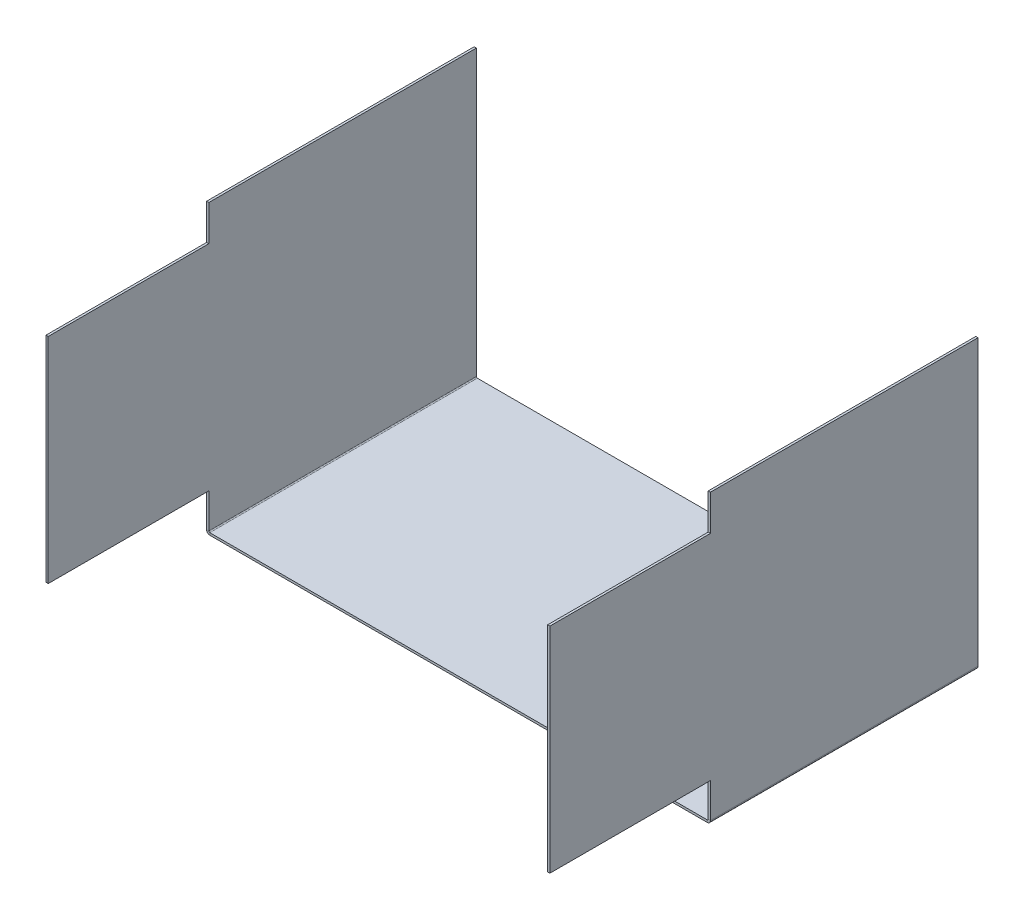
ISO-10303-21;
HEADER;
FILE_DESCRIPTION(('STEP AP214'),'2;1');
FILE_NAME('part.step','',(''),(''),'','','');
FILE_SCHEMA(('AUTOMOTIVE_DESIGN { 1 0 10303 214 1 1 1 1 }'));
ENDSEC;
DATA;
#1=APPLICATION_CONTEXT('core data for automotive mechanical design processes');
#2=APPLICATION_PROTOCOL_DEFINITION('international standard','automotive_design',2000,#1);
#3=PRODUCT_CONTEXT('',#1,'mechanical');
#4=PRODUCT('Part','Part','',(#3));
#5=PRODUCT_RELATED_PRODUCT_CATEGORY('part','',(#4));
#6=PRODUCT_DEFINITION_FORMATION('','',#4);
#7=PRODUCT_DEFINITION_CONTEXT('part definition',#1,'design');
#8=PRODUCT_DEFINITION('design','',#6,#7);
#9=PRODUCT_DEFINITION_SHAPE('','',#8);
#10=(LENGTH_UNIT() NAMED_UNIT(*) SI_UNIT(.MILLI.,.METRE.));
#11=(NAMED_UNIT(*) PLANE_ANGLE_UNIT() SI_UNIT($,.RADIAN.));
#12=(NAMED_UNIT(*) SI_UNIT($,.STERADIAN.) SOLID_ANGLE_UNIT());
#13=UNCERTAINTY_MEASURE_WITH_UNIT(LENGTH_MEASURE(1.E-05),#10,'distance_accuracy_value','');
#14=(GEOMETRIC_REPRESENTATION_CONTEXT(3) GLOBAL_UNCERTAINTY_ASSIGNED_CONTEXT((#13)) GLOBAL_UNIT_ASSIGNED_CONTEXT((#10,
#11,#12)) REPRESENTATION_CONTEXT('',''));
#15=CARTESIAN_POINT('',(0.,0.,0.));
#16=DIRECTION('',(0.,0.,1.));
#17=DIRECTION('',(1.,0.,0.));
#18=AXIS2_PLACEMENT_3D('',#15,#16,#17);
#19=CARTESIAN_POINT('',(-1.58750000000069,204.787500000001,127.));
#20=DIRECTION('',(0.,0.,1.));
#21=DIRECTION('',(0.,-1.,0.));
#22=AXIS2_PLACEMENT_3D('',#19,#20,#21);
#23=PLANE('',#22);
#24=DIRECTION('',(0.,-1.,0.));
#25=VECTOR('',#24,1.);
#26=CARTESIAN_POINT('',(0.,0.,127.));
#27=LINE('',#26,#25);
#28=CARTESIAN_POINT('',(-7.09285061240017E-13,204.787500000001,127.));
#29=VERTEX_POINT('',#28);
#30=CARTESIAN_POINT('',(0.,2.32409999999998,127.));
#31=VERTEX_POINT('',#30);
#32=EDGE_CURVE('E288',#29,#31,#27,.T.);
#33=ORIENTED_EDGE('',*,*,#32,.T.);
#34=DIRECTION('',(-1.,0.,0.));
#35=VECTOR('',#34,1.);
#36=CARTESIAN_POINT('',(0.,2.32409999999998,127.));
#37=LINE('',#36,#35);
#38=CARTESIAN_POINT('',(-1.58750000000135,2.32409999999994,127.));
#39=VERTEX_POINT('',#38);
#40=EDGE_CURVE('E11',#31,#39,#37,.T.);
#41=ORIENTED_EDGE('',*,*,#40,.T.);
#42=DIRECTION('',(0.,-1.,0.));
#43=VECTOR('',#42,1.);
#44=CARTESIAN_POINT('',(-1.58750000000069,204.787500000001,127.));
#45=LINE('',#44,#43);
#46=CARTESIAN_POINT('',(-1.58750000000071,204.7875,127.));
#47=VERTEX_POINT('',#46);
#48=EDGE_CURVE('E55',#47,#39,#45,.T.);
#49=ORIENTED_EDGE('',*,*,#48,.F.);
#50=DIRECTION('',(1.,0.,0.));
#51=VECTOR('',#50,1.);
#52=CARTESIAN_POINT('',(-1.58750000000069,204.787500000001,127.));
#53=LINE('',#52,#51);
#54=EDGE_CURVE('E198',#47,#29,#53,.T.);
#55=ORIENTED_EDGE('',*,*,#54,.T.);
#56=EDGE_LOOP('',(#33,#41,#49,#55));
#57=FACE_BOUND('',#56,.T.);
#58=ADVANCED_FACE('F41',(#57),#23,.F.);
#59=DIRECTION('',(-1.,0.,0.));
#60=VECTOR('',#59,1.);
#61=CARTESIAN_POINT('',(355.6,0.,127.));
#62=LINE('',#61,#60);
#63=CARTESIAN_POINT('',(354.8634,0.,127.));
#64=VERTEX_POINT('',#63);
#65=CARTESIAN_POINT('',(0.736599999999995,0.,127.));
#66=VERTEX_POINT('',#65);
#67=EDGE_CURVE('E277',#64,#66,#62,.T.);
#68=ORIENTED_EDGE('',*,*,#67,.T.);
#69=DIRECTION('',(0.,1.,0.));
#70=VECTOR('',#69,1.);
#71=CARTESIAN_POINT('',(0.736599999999995,0.,127.));
#72=LINE('',#71,#70);
#73=CARTESIAN_POINT('',(0.736599999999995,1.58749999999999,127.));
#74=VERTEX_POINT('',#73);
#75=EDGE_CURVE('E49',#66,#74,#72,.T.);
#76=ORIENTED_EDGE('',*,*,#75,.T.);
#77=DIRECTION('',(-1.,0.,0.));
#78=VECTOR('',#77,1.);
#79=CARTESIAN_POINT('',(355.6,1.58749999999998,127.));
#80=LINE('',#79,#78);
#81=CARTESIAN_POINT('',(354.8634,1.58749999999998,127.));
#82=VERTEX_POINT('',#81);
#83=EDGE_CURVE('E274',#82,#74,#80,.T.);
#84=ORIENTED_EDGE('',*,*,#83,.F.);
#85=DIRECTION('',(0.,-1.,0.));
#86=VECTOR('',#85,1.);
#87=CARTESIAN_POINT('',(354.8634,1.58749999999998,127.));
#88=LINE('',#87,#86);
#89=EDGE_CURVE('E267',#82,#64,#88,.T.);
#90=ORIENTED_EDGE('',*,*,#89,.T.);
#91=EDGE_LOOP('',(#68,#76,#84,#90));
#92=FACE_BOUND('',#91,.T.);
#93=ADVANCED_FACE('F272',(#92),#23,.F.);
#94=ORIENTED_EDGE('',*,*,#40,.F.);
#95=CARTESIAN_POINT('',(0.736599999999995,2.32409999999998,127.));
#96=DIRECTION('',(0.,0.,1.));
#97=DIRECTION('',(0.,-1.,0.));
#98=AXIS2_PLACEMENT_3D('',#95,#96,#97);
#99=CIRCLE('',#98,0.736599999999988);
#100=EDGE_CURVE('E282',#74,#31,#99,.F.);
#101=ORIENTED_EDGE('',*,*,#100,.F.);
#102=ORIENTED_EDGE('',*,*,#75,.F.);
#103=CARTESIAN_POINT('',(0.736599999999995,2.32409999999998,127.));
#104=DIRECTION('',(0.,0.,1.));
#105=DIRECTION('',(0.,-1.,0.));
#106=AXIS2_PLACEMENT_3D('',#103,#104,#105);
#107=CIRCLE('',#106,2.32409999999999);
#108=EDGE_CURVE('E335',#66,#39,#107,.F.);
#109=ORIENTED_EDGE('',*,*,#108,.T.);
#110=EDGE_LOOP('',(#94,#101,#102,#109));
#111=FACE_BOUND('',#110,.T.);
#112=ADVANCED_FACE('F283',(#111),#23,.F.);
#113=DIRECTION('',(0.,-1.,0.));
#114=VECTOR('',#113,1.);
#115=CARTESIAN_POINT('',(357.187500000001,204.7875,127.));
#116=LINE('',#115,#114);
#117=CARTESIAN_POINT('',(357.187500000001,204.7875,127.));
#118=VERTEX_POINT('',#117);
#119=CARTESIAN_POINT('',(357.1875,2.32409999999997,127.));
#120=VERTEX_POINT('',#119);
#121=EDGE_CURVE('E191',#118,#120,#116,.T.);
#122=ORIENTED_EDGE('',*,*,#121,.T.);
#123=DIRECTION('',(-1.,0.,0.));
#124=VECTOR('',#123,1.);
#125=CARTESIAN_POINT('',(357.1875,2.32409999999997,127.));
#126=LINE('',#125,#124);
#127=CARTESIAN_POINT('',(355.6,2.32409999999997,127.));
#128=VERTEX_POINT('',#127);
#129=EDGE_CURVE('E261',#120,#128,#126,.T.);
#130=ORIENTED_EDGE('',*,*,#129,.T.);
#131=DIRECTION('',(0.,1.,0.));
#132=VECTOR('',#131,1.);
#133=CARTESIAN_POINT('',(355.6,-1.17917828279523E-12,127.));
#134=LINE('',#133,#132);
#135=CARTESIAN_POINT('',(355.600000000001,204.7875,127.));
#136=VERTEX_POINT('',#135);
#137=EDGE_CURVE('E194',#128,#136,#134,.T.);
#138=ORIENTED_EDGE('',*,*,#137,.T.);
#139=EDGE_CURVE('E188',#136,#118,#53,.T.);
#140=ORIENTED_EDGE('',*,*,#139,.T.);
#141=EDGE_LOOP('',(#122,#130,#138,#140));
#142=FACE_BOUND('',#141,.T.);
#143=ADVANCED_FACE('F190',(#142),#23,.F.);
#144=CARTESIAN_POINT('',(355.600000000001,179.3875,431.8));
#145=DIRECTION('',(0.,1.,0.));
#146=DIRECTION('',(-1.,0.,0.));
#147=AXIS2_PLACEMENT_3D('',#144,#145,#146);
#148=PLANE('',#147);
#149=DIRECTION('',(0.,0.,1.));
#150=VECTOR('',#149,1.);
#151=CARTESIAN_POINT('',(357.187500000001,179.3875,431.8));
#152=LINE('',#151,#150);
#153=CARTESIAN_POINT('',(357.187500000001,179.3875,317.5));
#154=VERTEX_POINT('',#153);
#155=CARTESIAN_POINT('',(357.187500000001,179.3875,431.8));
#156=VERTEX_POINT('',#155);
#157=EDGE_CURVE('E246',#154,#156,#152,.T.);
#158=ORIENTED_EDGE('',*,*,#157,.F.);
#159=DIRECTION('',(1.,0.,0.));
#160=VECTOR('',#159,1.);
#161=CARTESIAN_POINT('',(355.600000000001,179.3875,317.5));
#162=LINE('',#161,#160);
#163=CARTESIAN_POINT('',(355.600000000001,179.3875,317.5));
#164=VERTEX_POINT('',#163);
#165=EDGE_CURVE('E64',#164,#154,#162,.T.);
#166=ORIENTED_EDGE('',*,*,#165,.F.);
#167=DIRECTION('',(0.,0.,1.));
#168=VECTOR('',#167,1.);
#169=CARTESIAN_POINT('',(355.600000000001,179.3875,431.8));
#170=LINE('',#169,#168);
#171=CARTESIAN_POINT('',(355.600000000001,179.3875,431.8));
#172=VERTEX_POINT('',#171);
#173=EDGE_CURVE('E247',#164,#172,#170,.T.);
#174=ORIENTED_EDGE('',*,*,#173,.T.);
#175=DIRECTION('',(1.,0.,0.));
#176=VECTOR('',#175,1.);
#177=CARTESIAN_POINT('',(355.600000000001,179.3875,431.8));
#178=LINE('',#177,#176);
#179=EDGE_CURVE('E90',#172,#156,#178,.T.);
#180=ORIENTED_EDGE('',*,*,#179,.T.);
#181=EDGE_LOOP('',(#158,#166,#174,#180));
#182=FACE_BOUND('',#181,.T.);
#183=ADVANCED_FACE('F43',(#182),#148,.T.);
#184=CARTESIAN_POINT('',(355.6,26.9875,317.5));
#185=DIRECTION('',(0.,-1.,0.));
#186=DIRECTION('',(1.,0.,0.));
#187=AXIS2_PLACEMENT_3D('',#184,#185,#186);
#188=PLANE('',#187);
#189=DIRECTION('',(0.,0.,-1.));
#190=VECTOR('',#189,1.);
#191=CARTESIAN_POINT('',(357.1875,26.9875,317.5));
#192=LINE('',#191,#190);
#193=CARTESIAN_POINT('',(357.1875,26.9875,431.8));
#194=VERTEX_POINT('',#193);
#195=CARTESIAN_POINT('',(357.1875,26.9875,317.5));
#196=VERTEX_POINT('',#195);
#197=EDGE_CURVE('E250',#194,#196,#192,.T.);
#198=ORIENTED_EDGE('',*,*,#197,.F.);
#199=DIRECTION('',(1.,0.,0.));
#200=VECTOR('',#199,1.);
#201=CARTESIAN_POINT('',(355.6,26.9875,431.8));
#202=LINE('',#201,#200);
#203=CARTESIAN_POINT('',(355.6,26.9875,431.8));
#204=VERTEX_POINT('',#203);
#205=EDGE_CURVE('E263',#204,#194,#202,.T.);
#206=ORIENTED_EDGE('',*,*,#205,.F.);
#207=DIRECTION('',(0.,0.,-1.));
#208=VECTOR('',#207,1.);
#209=CARTESIAN_POINT('',(355.6,26.9875,317.5));
#210=LINE('',#209,#208);
#211=CARTESIAN_POINT('',(355.6,26.9875,317.5));
#212=VERTEX_POINT('',#211);
#213=EDGE_CURVE('E252',#204,#212,#210,.T.);
#214=ORIENTED_EDGE('',*,*,#213,.T.);
#215=DIRECTION('',(1.,0.,0.));
#216=VECTOR('',#215,1.);
#217=CARTESIAN_POINT('',(355.6,26.9875,317.5));
#218=LINE('',#217,#216);
#219=EDGE_CURVE('E83',#212,#196,#218,.T.);
#220=ORIENTED_EDGE('',*,*,#219,.T.);
#221=EDGE_LOOP('',(#198,#206,#214,#220));
#222=FACE_BOUND('',#221,.T.);
#223=ADVANCED_FACE('F437',(#222),#188,.T.);
#224=CARTESIAN_POINT('',(355.6,26.9875,431.8));
#225=DIRECTION('',(0.,0.,1.));
#226=DIRECTION('',(1.,0.,0.));
#227=AXIS2_PLACEMENT_3D('',#224,#225,#226);
#228=PLANE('',#227);
#229=DIRECTION('',(0.,-1.,0.));
#230=VECTOR('',#229,1.);
#231=CARTESIAN_POINT('',(357.1875,26.9875,431.8));
#232=LINE('',#231,#230);
#233=EDGE_CURVE('E256',#156,#194,#232,.T.);
#234=ORIENTED_EDGE('',*,*,#233,.F.);
#235=ORIENTED_EDGE('',*,*,#179,.F.);
#236=DIRECTION('',(0.,-1.,0.));
#237=VECTOR('',#236,1.);
#238=CARTESIAN_POINT('',(355.6,26.9875,431.8));
#239=LINE('',#238,#237);
#240=EDGE_CURVE('E249',#172,#204,#239,.T.);
#241=ORIENTED_EDGE('',*,*,#240,.T.);
#242=ORIENTED_EDGE('',*,*,#205,.T.);
#243=EDGE_LOOP('',(#234,#235,#241,#242));
#244=FACE_BOUND('',#243,.T.);
#245=ADVANCED_FACE('F557',(#244),#228,.T.);
#246=CARTESIAN_POINT('',(355.6,-1.16530049498742E-12,0.));
#247=DIRECTION('',(-1.,0.,0.));
#248=DIRECTION('',(0.,-1.,0.));
#249=AXIS2_PLACEMENT_3D('',#246,#247,#248);
#250=PLANE('',#249);
#251=ORIENTED_EDGE('',*,*,#137,.F.);
#252=DIRECTION('',(0.,0.,-1.));
#253=VECTOR('',#252,1.);
#254=CARTESIAN_POINT('',(355.6,2.32409999999994,317.5));
#255=LINE('',#254,#253);
#256=CARTESIAN_POINT('',(355.6,2.32409999999997,317.5));
#257=VERTEX_POINT('',#256);
#258=EDGE_CURVE('E315',#257,#128,#255,.T.);
#259=ORIENTED_EDGE('',*,*,#258,.F.);
#260=DIRECTION('',(0.,-1.,0.));
#261=VECTOR('',#260,1.);
#262=CARTESIAN_POINT('',(355.6,1.58749999999996,317.5));
#263=LINE('',#262,#261);
#264=EDGE_CURVE('E219',#212,#257,#263,.T.);
#265=ORIENTED_EDGE('',*,*,#264,.F.);
#266=ORIENTED_EDGE('',*,*,#213,.F.);
#267=ORIENTED_EDGE('',*,*,#240,.F.);
#268=ORIENTED_EDGE('',*,*,#173,.F.);
#269=CARTESIAN_POINT('',(355.600000000001,204.7875,317.5));
#270=VERTEX_POINT('',#269);
#271=EDGE_CURVE('E214',#270,#164,#263,.T.);
#272=ORIENTED_EDGE('',*,*,#271,.F.);
#273=DIRECTION('',(0.,0.,1.));
#274=VECTOR('',#273,1.);
#275=CARTESIAN_POINT('',(355.600000000001,204.7875,317.5));
#276=LINE('',#275,#274);
#277=EDGE_CURVE('E224',#136,#270,#276,.T.);
#278=ORIENTED_EDGE('',*,*,#277,.F.);
#279=EDGE_LOOP('',(#251,#259,#265,#266,#267,#268,#272,#278));
#280=FACE_BOUND('',#279,.T.);
#281=ADVANCED_FACE('F332',(#280),#250,.T.);
#282=CARTESIAN_POINT('',(357.1875,-1.17093834628434E-12,0.));
#283=DIRECTION('',(-1.,0.,0.));
#284=DIRECTION('',(0.,-1.,0.));
#285=AXIS2_PLACEMENT_3D('',#282,#283,#284);
#286=PLANE('',#285);
#287=DIRECTION('',(0.,0.,1.));
#288=VECTOR('',#287,1.);
#289=CARTESIAN_POINT('',(357.1875,2.32409999999999,0.));
#290=LINE('',#289,#288);
#291=CARTESIAN_POINT('',(357.1875,2.32409999999996,317.5));
#292=VERTEX_POINT('',#291);
#293=EDGE_CURVE('E207',#120,#292,#290,.T.);
#294=ORIENTED_EDGE('',*,*,#293,.F.);
#295=ORIENTED_EDGE('',*,*,#121,.F.);
#296=DIRECTION('',(0.,0.,1.));
#297=VECTOR('',#296,1.);
#298=CARTESIAN_POINT('',(357.187500000001,204.7875,317.5));
#299=LINE('',#298,#297);
#300=CARTESIAN_POINT('',(357.187500000001,204.7875,317.5));
#301=VERTEX_POINT('',#300);
#302=EDGE_CURVE('E204',#118,#301,#299,.T.);
#303=ORIENTED_EDGE('',*,*,#302,.T.);
#304=DIRECTION('',(0.,-1.,0.));
#305=VECTOR('',#304,1.);
#306=CARTESIAN_POINT('',(357.1875,1.58749999999996,317.5));
#307=LINE('',#306,#305);
#308=EDGE_CURVE('E216',#301,#154,#307,.T.);
#309=ORIENTED_EDGE('',*,*,#308,.T.);
#310=ORIENTED_EDGE('',*,*,#157,.T.);
#311=ORIENTED_EDGE('',*,*,#233,.T.);
#312=ORIENTED_EDGE('',*,*,#197,.T.);
#313=EDGE_CURVE('E213',#196,#292,#307,.T.);
#314=ORIENTED_EDGE('',*,*,#313,.T.);
#315=EDGE_LOOP('',(#294,#295,#303,#309,#310,#311,#312,#314));
#316=FACE_BOUND('',#315,.T.);
#317=ADVANCED_FACE('F202',(#316),#286,.F.);
#318=CARTESIAN_POINT('',(357.1875,1.58749999999996,317.5));
#319=DIRECTION('',(0.,0.,-1.));
#320=DIRECTION('',(-1.,0.,0.));
#321=AXIS2_PLACEMENT_3D('',#318,#319,#320);
#322=PLANE('',#321);
#323=ORIENTED_EDGE('',*,*,#271,.T.);
#324=ORIENTED_EDGE('',*,*,#165,.T.);
#325=ORIENTED_EDGE('',*,*,#308,.F.);
#326=DIRECTION('',(-1.,0.,0.));
#327=VECTOR('',#326,1.);
#328=CARTESIAN_POINT('',(357.187500000001,204.7875,317.5));
#329=LINE('',#328,#327);
#330=EDGE_CURVE('E211',#301,#270,#329,.T.);
#331=ORIENTED_EDGE('',*,*,#330,.T.);
#332=EDGE_LOOP('',(#323,#324,#325,#331));
#333=FACE_BOUND('',#332,.T.);
#334=ADVANCED_FACE('F515',(#333),#322,.F.);
#335=CARTESIAN_POINT('',(-1.58750000000071,204.7875,317.5));
#336=DIRECTION('',(0.,0.,-1.));
#337=DIRECTION('',(-1.,0.,0.));
#338=AXIS2_PLACEMENT_3D('',#335,#336,#337);
#339=PLANE('',#338);
#340=DIRECTION('',(-1.,0.,0.));
#341=VECTOR('',#340,1.);
#342=CARTESIAN_POINT('',(-6.10622663543836E-13,179.3875,317.5));
#343=LINE('',#342,#341);
#344=CARTESIAN_POINT('',(-6.10622663543836E-13,179.3875,317.5));
#345=VERTEX_POINT('',#344);
#346=CARTESIAN_POINT('',(-1.58750000000063,179.3875,317.5));
#347=VERTEX_POINT('',#346);
#348=EDGE_CURVE('E359',#345,#347,#343,.T.);
#349=ORIENTED_EDGE('',*,*,#348,.F.);
#350=DIRECTION('',(0.,1.,0.));
#351=VECTOR('',#350,1.);
#352=CARTESIAN_POINT('',(-7.09469008052925E-13,204.7875,317.5));
#353=LINE('',#352,#351);
#354=CARTESIAN_POINT('',(-7.09469008052925E-13,204.7875,317.5));
#355=VERTEX_POINT('',#354);
#356=EDGE_CURVE('E377',#345,#355,#353,.T.);
#357=ORIENTED_EDGE('',*,*,#356,.T.);
#358=DIRECTION('',(1.,0.,0.));
#359=VECTOR('',#358,1.);
#360=CARTESIAN_POINT('',(-1.58750000000071,204.7875,317.5));
#361=LINE('',#360,#359);
#362=CARTESIAN_POINT('',(-1.58750000000071,204.7875,317.5));
#363=VERTEX_POINT('',#362);
#364=EDGE_CURVE('E307',#363,#355,#361,.T.);
#365=ORIENTED_EDGE('',*,*,#364,.F.);
#366=DIRECTION('',(0.,1.,0.));
#367=VECTOR('',#366,1.);
#368=CARTESIAN_POINT('',(-1.58750000000071,204.7875,317.5));
#369=LINE('',#368,#367);
#370=EDGE_CURVE('E382',#347,#363,#369,.T.);
#371=ORIENTED_EDGE('',*,*,#370,.F.);
#372=EDGE_LOOP('',(#349,#357,#365,#371));
#373=FACE_BOUND('',#372,.T.);
#374=ADVANCED_FACE('F492',(#373),#339,.F.);
#375=CARTESIAN_POINT('',(355.6,1.5875,0.));
#376=DIRECTION('',(0.,-1.,0.));
#377=DIRECTION('',(0.,0.,-1.));
#378=AXIS2_PLACEMENT_3D('',#375,#376,#377);
#379=PLANE('',#378);
#380=DIRECTION('',(0.,0.,-1.));
#381=VECTOR('',#380,1.);
#382=CARTESIAN_POINT('',(354.8634,1.58749999999999,0.));
#383=LINE('',#382,#381);
#384=CARTESIAN_POINT('',(354.8634,1.58749999999999,317.5));
#385=VERTEX_POINT('',#384);
#386=EDGE_CURVE('E227',#82,#385,#383,.F.);
#387=ORIENTED_EDGE('',*,*,#386,.F.);
#388=ORIENTED_EDGE('',*,*,#83,.T.);
#389=DIRECTION('',(0.,0.,1.));
#390=VECTOR('',#389,1.);
#391=CARTESIAN_POINT('',(0.736599999999997,1.58749999999999,317.5));
#392=LINE('',#391,#390);
#393=CARTESIAN_POINT('',(0.736599999999997,1.58749999999999,317.5));
#394=VERTEX_POINT('',#393);
#395=EDGE_CURVE('E295',#394,#74,#392,.F.);
#396=ORIENTED_EDGE('',*,*,#395,.F.);
#397=DIRECTION('',(-1.,0.,0.));
#398=VECTOR('',#397,1.);
#399=CARTESIAN_POINT('',(355.6,1.58749999999996,317.5));
#400=LINE('',#399,#398);
#401=EDGE_CURVE('E243',#385,#394,#400,.T.);
#402=ORIENTED_EDGE('',*,*,#401,.F.);
#403=EDGE_LOOP('',(#387,#388,#396,#402));
#404=FACE_BOUND('',#403,.T.);
#405=ADVANCED_FACE('F293',(#404),#379,.F.);
#406=CARTESIAN_POINT('',(355.6,0.,0.));
#407=DIRECTION('',(0.,-1.,0.));
#408=DIRECTION('',(0.,0.,-1.));
#409=AXIS2_PLACEMENT_3D('',#406,#407,#408);
#410=PLANE('',#409);
#411=ORIENTED_EDGE('',*,*,#67,.F.);
#412=DIRECTION('',(0.,0.,-1.));
#413=VECTOR('',#412,1.);
#414=CARTESIAN_POINT('',(354.8634,0.,0.));
#415=LINE('',#414,#413);
#416=CARTESIAN_POINT('',(354.8634,0.,317.5));
#417=VERTEX_POINT('',#416);
#418=EDGE_CURVE('E228',#64,#417,#415,.F.);
#419=ORIENTED_EDGE('',*,*,#418,.T.);
#420=DIRECTION('',(-1.,0.,0.));
#421=VECTOR('',#420,1.);
#422=CARTESIAN_POINT('',(355.6,0.,317.5));
#423=LINE('',#422,#421);
#424=CARTESIAN_POINT('',(0.736599999999973,0.,317.5));
#425=VERTEX_POINT('',#424);
#426=EDGE_CURVE('E240',#417,#425,#423,.T.);
#427=ORIENTED_EDGE('',*,*,#426,.T.);
#428=DIRECTION('',(0.,0.,1.));
#429=VECTOR('',#428,1.);
#430=CARTESIAN_POINT('',(0.736599999999973,0.,317.5));
#431=LINE('',#430,#429);
#432=EDGE_CURVE('E305',#425,#66,#431,.F.);
#433=ORIENTED_EDGE('',*,*,#432,.T.);
#434=EDGE_LOOP('',(#411,#419,#427,#433));
#435=FACE_BOUND('',#434,.T.);
#436=ADVANCED_FACE('F394',(#435),#410,.T.);
#437=CARTESIAN_POINT('',(355.6,0.,317.5));
#438=DIRECTION('',(0.,0.,1.));
#439=DIRECTION('',(1.,0.,0.));
#440=AXIS2_PLACEMENT_3D('',#437,#438,#439);
#441=PLANE('',#440);
#442=ORIENTED_EDGE('',*,*,#401,.T.);
#443=DIRECTION('',(0.,-1.,0.));
#444=VECTOR('',#443,1.);
#445=CARTESIAN_POINT('',(0.736599999999997,1.58749999999999,317.5));
#446=LINE('',#445,#444);
#447=EDGE_CURVE('E311',#394,#425,#446,.T.);
#448=ORIENTED_EDGE('',*,*,#447,.T.);
#449=ORIENTED_EDGE('',*,*,#426,.F.);
#450=DIRECTION('',(0.,-1.,0.));
#451=VECTOR('',#450,1.);
#452=CARTESIAN_POINT('',(354.8634,1.58749999999999,317.5));
#453=LINE('',#452,#451);
#454=EDGE_CURVE('E234',#385,#417,#453,.T.);
#455=ORIENTED_EDGE('',*,*,#454,.F.);
#456=EDGE_LOOP('',(#442,#448,#449,#455));
#457=FACE_BOUND('',#456,.T.);
#458=ADVANCED_FACE('F404',(#457),#441,.T.);
#459=CARTESIAN_POINT('',(354.8634,2.32409999999997,317.5));
#460=DIRECTION('',(0.,0.,1.));
#461=DIRECTION('',(1.,0.,0.));
#462=AXIS2_PLACEMENT_3D('',#459,#460,#461);
#463=PLANE('',#462);
#464=DIRECTION('',(1.,0.,0.));
#465=VECTOR('',#464,1.);
#466=CARTESIAN_POINT('',(355.6,2.32409999999994,317.5));
#467=LINE('',#466,#465);
#468=EDGE_CURVE('E314',#257,#292,#467,.T.);
#469=ORIENTED_EDGE('',*,*,#468,.F.);
#470=CARTESIAN_POINT('',(354.8634,2.32409999999997,317.5));
#471=DIRECTION('',(0.,0.,-1.));
#472=DIRECTION('',(-1.,0.,0.));
#473=AXIS2_PLACEMENT_3D('',#470,#471,#472);
#474=CIRCLE('',#473,0.736599999999976);
#475=EDGE_CURVE('E231',#385,#257,#474,.F.);
#476=ORIENTED_EDGE('',*,*,#475,.F.);
#477=ORIENTED_EDGE('',*,*,#454,.T.);
#478=CARTESIAN_POINT('',(354.8634,2.32409999999997,317.5));
#479=DIRECTION('',(0.,0.,-1.));
#480=DIRECTION('',(-1.,0.,0.));
#481=AXIS2_PLACEMENT_3D('',#478,#479,#480);
#482=CIRCLE('',#481,2.32409999999998);
#483=EDGE_CURVE('E230',#417,#292,#482,.F.);
#484=ORIENTED_EDGE('',*,*,#483,.T.);
#485=EDGE_LOOP('',(#469,#476,#477,#484));
#486=FACE_BOUND('',#485,.T.);
#487=ADVANCED_FACE('F325',(#486),#463,.T.);
#488=CARTESIAN_POINT('',(354.8634,2.32409999999997,0.));
#489=DIRECTION('',(0.,0.,-1.));
#490=DIRECTION('',(1.,0.,0.));
#491=AXIS2_PLACEMENT_3D('',#488,#489,#490);
#492=CYLINDRICAL_SURFACE('',#491,2.32409999999998);
#493=CARTESIAN_POINT('',(354.8634,2.32409999999997,127.));
#494=DIRECTION('',(0.,0.,1.));
#495=DIRECTION('',(0.,-1.,0.));
#496=AXIS2_PLACEMENT_3D('',#493,#494,#495);
#497=CIRCLE('',#496,2.32409999999998);
#498=EDGE_CURVE('E341',#120,#64,#497,.F.);
#499=ORIENTED_EDGE('',*,*,#498,.F.);
#500=ORIENTED_EDGE('',*,*,#293,.T.);
#501=ORIENTED_EDGE('',*,*,#483,.F.);
#502=ORIENTED_EDGE('',*,*,#418,.F.);
#503=EDGE_LOOP('',(#499,#500,#501,#502));
#504=FACE_BOUND('',#503,.T.);
#505=ADVANCED_FACE('F410',(#504),#492,.T.);
#506=CARTESIAN_POINT('',(354.8634,2.32409999999997,0.));
#507=DIRECTION('',(0.,0.,-1.));
#508=DIRECTION('',(1.,0.,0.));
#509=AXIS2_PLACEMENT_3D('',#506,#507,#508);
#510=CYLINDRICAL_SURFACE('',#509,0.736599999999976);
#511=ORIENTED_EDGE('',*,*,#258,.T.);
#512=CARTESIAN_POINT('',(354.8634,2.32409999999997,127.));
#513=DIRECTION('',(0.,0.,1.));
#514=DIRECTION('',(0.,-1.,0.));
#515=AXIS2_PLACEMENT_3D('',#512,#513,#514);
#516=CIRCLE('',#515,0.736599999999976);
#517=EDGE_CURVE('E296',#128,#82,#516,.F.);
#518=ORIENTED_EDGE('',*,*,#517,.T.);
#519=ORIENTED_EDGE('',*,*,#386,.T.);
#520=ORIENTED_EDGE('',*,*,#475,.T.);
#521=EDGE_LOOP('',(#511,#518,#519,#520));
#522=FACE_BOUND('',#521,.T.);
#523=ADVANCED_FACE('F330',(#522),#510,.F.);
#524=ORIENTED_EDGE('',*,*,#219,.F.);
#525=ORIENTED_EDGE('',*,*,#264,.T.);
#526=ORIENTED_EDGE('',*,*,#468,.T.);
#527=ORIENTED_EDGE('',*,*,#313,.F.);
#528=EDGE_LOOP('',(#524,#525,#526,#527));
#529=FACE_BOUND('',#528,.T.);
#530=ADVANCED_FACE('F321',(#529),#322,.F.);
#531=CARTESIAN_POINT('',(357.187500000001,204.7875,317.5));
#532=DIRECTION('',(0.,-1.,0.));
#533=DIRECTION('',(1.,0.,0.));
#534=AXIS2_PLACEMENT_3D('',#531,#532,#533);
#535=PLANE('',#534);
#536=ORIENTED_EDGE('',*,*,#302,.F.);
#537=ORIENTED_EDGE('',*,*,#139,.F.);
#538=ORIENTED_EDGE('',*,*,#277,.T.);
#539=ORIENTED_EDGE('',*,*,#330,.F.);
#540=EDGE_LOOP('',(#536,#537,#538,#539));
#541=FACE_BOUND('',#540,.T.);
#542=ADVANCED_FACE('F209',(#541),#535,.F.);
#543=CARTESIAN_POINT('',(0.736600000000009,2.32409999999998,317.5));
#544=DIRECTION('',(0.,0.,-1.));
#545=DIRECTION('',(-1.,0.,0.));
#546=AXIS2_PLACEMENT_3D('',#543,#544,#545);
#547=PLANE('',#546);
#548=CARTESIAN_POINT('',(0.736600000000009,2.32409999999998,317.5));
#549=DIRECTION('',(0.,0.,1.));
#550=DIRECTION('',(1.,0.,0.));
#551=AXIS2_PLACEMENT_3D('',#548,#549,#550);
#552=CIRCLE('',#551,0.736599999999988);
#553=CARTESIAN_POINT('',(0.,2.32409999999998,317.5));
#554=VERTEX_POINT('',#553);
#555=EDGE_CURVE('E301',#554,#394,#552,.T.);
#556=ORIENTED_EDGE('',*,*,#555,.F.);
#557=DIRECTION('',(-1.,0.,0.));
#558=VECTOR('',#557,1.);
#559=CARTESIAN_POINT('',(0.,2.32409999999996,317.5));
#560=LINE('',#559,#558);
#561=CARTESIAN_POINT('',(-1.5875,2.32409999999995,317.5));
#562=VERTEX_POINT('',#561);
#563=EDGE_CURVE('E371',#554,#562,#560,.T.);
#564=ORIENTED_EDGE('',*,*,#563,.T.);
#565=CARTESIAN_POINT('',(0.736600000000009,2.32409999999998,317.5));
#566=DIRECTION('',(0.,0.,1.));
#567=DIRECTION('',(1.,0.,0.));
#568=AXIS2_PLACEMENT_3D('',#565,#566,#567);
#569=CIRCLE('',#568,2.32409999999999);
#570=EDGE_CURVE('E302',#562,#425,#569,.T.);
#571=ORIENTED_EDGE('',*,*,#570,.T.);
#572=ORIENTED_EDGE('',*,*,#447,.F.);
#573=EDGE_LOOP('',(#556,#564,#571,#572));
#574=FACE_BOUND('',#573,.T.);
#575=ADVANCED_FACE('F400',(#574),#547,.F.);
#576=CARTESIAN_POINT('',(0.736600000000009,2.32409999999998,317.5));
#577=DIRECTION('',(0.,0.,1.));
#578=DIRECTION('',(-1.,0.,0.));
#579=AXIS2_PLACEMENT_3D('',#576,#577,#578);
#580=CYLINDRICAL_SURFACE('',#579,2.32409999999999);
#581=ORIENTED_EDGE('',*,*,#108,.F.);
#582=ORIENTED_EDGE('',*,*,#432,.F.);
#583=ORIENTED_EDGE('',*,*,#570,.F.);
#584=DIRECTION('',(0.,0.,-1.));
#585=VECTOR('',#584,1.);
#586=CARTESIAN_POINT('',(-1.5875,2.32409999999999,0.));
#587=LINE('',#586,#585);
#588=EDGE_CURVE('E374',#562,#39,#587,.T.);
#589=ORIENTED_EDGE('',*,*,#588,.T.);
#590=EDGE_LOOP('',(#581,#582,#583,#589));
#591=FACE_BOUND('',#590,.T.);
#592=ADVANCED_FACE('F398',(#591),#580,.T.);
#593=CARTESIAN_POINT('',(0.736600000000009,2.32409999999998,317.5));
#594=DIRECTION('',(0.,0.,1.));
#595=DIRECTION('',(-1.,0.,0.));
#596=AXIS2_PLACEMENT_3D('',#593,#594,#595);
#597=CYLINDRICAL_SURFACE('',#596,0.736599999999988);
#598=ORIENTED_EDGE('',*,*,#395,.T.);
#599=ORIENTED_EDGE('',*,*,#100,.T.);
#600=DIRECTION('',(0.,0.,1.));
#601=VECTOR('',#600,1.);
#602=CARTESIAN_POINT('',(0.,2.3241,0.));
#603=LINE('',#602,#601);
#604=EDGE_CURVE('E361',#31,#554,#603,.T.);
#605=ORIENTED_EDGE('',*,*,#604,.T.);
#606=ORIENTED_EDGE('',*,*,#555,.T.);
#607=EDGE_LOOP('',(#598,#599,#605,#606));
#608=FACE_BOUND('',#607,.T.);
#609=ADVANCED_FACE('F299',(#608),#597,.F.);
#610=CARTESIAN_POINT('',(-1.11022302462516E-13,26.9875,317.5));
#611=VERTEX_POINT('',#610);
#612=EDGE_CURVE('E385',#554,#611,#353,.T.);
#613=ORIENTED_EDGE('',*,*,#612,.T.);
#614=DIRECTION('',(-1.,0.,0.));
#615=VECTOR('',#614,1.);
#616=CARTESIAN_POINT('',(-1.11022302462516E-13,26.9875,317.5));
#617=LINE('',#616,#615);
#618=CARTESIAN_POINT('',(-1.58750000000009,26.9875,317.5));
#619=VERTEX_POINT('',#618);
#620=EDGE_CURVE('E362',#611,#619,#617,.T.);
#621=ORIENTED_EDGE('',*,*,#620,.T.);
#622=EDGE_CURVE('E378',#562,#619,#369,.T.);
#623=ORIENTED_EDGE('',*,*,#622,.F.);
#624=ORIENTED_EDGE('',*,*,#563,.F.);
#625=EDGE_LOOP('',(#613,#621,#623,#624));
#626=FACE_BOUND('',#625,.T.);
#627=ADVANCED_FACE('F484',(#626),#339,.F.);
#628=CARTESIAN_POINT('',(-1.58749999999999,0.,0.));
#629=DIRECTION('',(1.,0.,0.));
#630=DIRECTION('',(0.,1.,0.));
#631=AXIS2_PLACEMENT_3D('',#628,#629,#630);
#632=PLANE('',#631);
#633=DIRECTION('',(0.,0.,-1.));
#634=VECTOR('',#633,1.);
#635=CARTESIAN_POINT('',(-1.58750000000071,204.7875,0.));
#636=LINE('',#635,#634);
#637=EDGE_CURVE('E381',#363,#47,#636,.T.);
#638=ORIENTED_EDGE('',*,*,#637,.T.);
#639=ORIENTED_EDGE('',*,*,#48,.T.);
#640=ORIENTED_EDGE('',*,*,#588,.F.);
#641=ORIENTED_EDGE('',*,*,#622,.T.);
#642=DIRECTION('',(0.,0.,-1.));
#643=VECTOR('',#642,1.);
#644=CARTESIAN_POINT('',(-1.58750000000013,26.9875,317.5));
#645=LINE('',#644,#643);
#646=CARTESIAN_POINT('',(-1.58750000000013,26.9875,431.8));
#647=VERTEX_POINT('',#646);
#648=EDGE_CURVE('E349',#647,#619,#645,.T.);
#649=ORIENTED_EDGE('',*,*,#648,.F.);
#650=DIRECTION('',(0.,-1.,0.));
#651=VECTOR('',#650,1.);
#652=CARTESIAN_POINT('',(-1.58750000000013,26.9875,431.8));
#653=LINE('',#652,#651);
#654=CARTESIAN_POINT('',(-1.58750000000063,179.3875,431.8));
#655=VERTEX_POINT('',#654);
#656=EDGE_CURVE('E356',#655,#647,#653,.T.);
#657=ORIENTED_EDGE('',*,*,#656,.F.);
#658=DIRECTION('',(0.,0.,1.));
#659=VECTOR('',#658,1.);
#660=CARTESIAN_POINT('',(-1.58750000000063,179.3875,431.8));
#661=LINE('',#660,#659);
#662=EDGE_CURVE('E344',#347,#655,#661,.T.);
#663=ORIENTED_EDGE('',*,*,#662,.F.);
#664=ORIENTED_EDGE('',*,*,#370,.T.);
#665=EDGE_LOOP('',(#638,#639,#640,#641,#649,#657,#663,#664));
#666=FACE_BOUND('',#665,.T.);
#667=ADVANCED_FACE('F489',(#666),#632,.F.);
#668=CARTESIAN_POINT('',(0.,0.,0.));
#669=DIRECTION('',(1.,0.,0.));
#670=DIRECTION('',(0.,1.,0.));
#671=AXIS2_PLACEMENT_3D('',#668,#669,#670);
#672=PLANE('',#671);
#673=ORIENTED_EDGE('',*,*,#32,.F.);
#674=DIRECTION('',(0.,0.,-1.));
#675=VECTOR('',#674,1.);
#676=CARTESIAN_POINT('',(-7.09469008052925E-13,204.7875,0.));
#677=LINE('',#676,#675);
#678=EDGE_CURVE('E388',#355,#29,#677,.T.);
#679=ORIENTED_EDGE('',*,*,#678,.F.);
#680=ORIENTED_EDGE('',*,*,#356,.F.);
#681=DIRECTION('',(0.,0.,1.));
#682=VECTOR('',#681,1.);
#683=CARTESIAN_POINT('',(-6.10622663543836E-13,179.3875,431.8));
#684=LINE('',#683,#682);
#685=CARTESIAN_POINT('',(-6.10622663543836E-13,179.3875,431.8));
#686=VERTEX_POINT('',#685);
#687=EDGE_CURVE('E345',#345,#686,#684,.T.);
#688=ORIENTED_EDGE('',*,*,#687,.T.);
#689=DIRECTION('',(0.,-1.,0.));
#690=VECTOR('',#689,1.);
#691=CARTESIAN_POINT('',(-1.11022302462516E-13,26.9875,431.8));
#692=LINE('',#691,#690);
#693=CARTESIAN_POINT('',(-1.11022302462516E-13,26.9875,431.8));
#694=VERTEX_POINT('',#693);
#695=EDGE_CURVE('E348',#686,#694,#692,.T.);
#696=ORIENTED_EDGE('',*,*,#695,.T.);
#697=DIRECTION('',(0.,0.,-1.));
#698=VECTOR('',#697,1.);
#699=CARTESIAN_POINT('',(-1.11022302462516E-13,26.9875,317.5));
#700=LINE('',#699,#698);
#701=EDGE_CURVE('E351',#694,#611,#700,.T.);
#702=ORIENTED_EDGE('',*,*,#701,.T.);
#703=ORIENTED_EDGE('',*,*,#612,.F.);
#704=ORIENTED_EDGE('',*,*,#604,.F.);
#705=EDGE_LOOP('',(#673,#679,#680,#688,#696,#702,#703,#704));
#706=FACE_BOUND('',#705,.T.);
#707=ADVANCED_FACE('F667',(#706),#672,.T.);
#708=CARTESIAN_POINT('',(-1.58750000000071,204.7875,0.));
#709=DIRECTION('',(0.,-1.,0.));
#710=DIRECTION('',(1.,0.,0.));
#711=AXIS2_PLACEMENT_3D('',#708,#709,#710);
#712=PLANE('',#711);
#713=ORIENTED_EDGE('',*,*,#678,.T.);
#714=ORIENTED_EDGE('',*,*,#54,.F.);
#715=ORIENTED_EDGE('',*,*,#637,.F.);
#716=ORIENTED_EDGE('',*,*,#364,.T.);
#717=EDGE_LOOP('',(#713,#714,#715,#716));
#718=FACE_BOUND('',#717,.T.);
#719=ADVANCED_FACE('F477',(#718),#712,.F.);
#720=CARTESIAN_POINT('',(-6.10622663543836E-13,179.3875,431.8));
#721=DIRECTION('',(0.,1.,0.));
#722=DIRECTION('',(1.,0.,0.));
#723=AXIS2_PLACEMENT_3D('',#720,#721,#722);
#724=PLANE('',#723);
#725=ORIENTED_EDGE('',*,*,#662,.T.);
#726=DIRECTION('',(-1.,0.,0.));
#727=VECTOR('',#726,1.);
#728=CARTESIAN_POINT('',(-6.10622663543836E-13,179.3875,431.8));
#729=LINE('',#728,#727);
#730=EDGE_CURVE('E353',#686,#655,#729,.T.);
#731=ORIENTED_EDGE('',*,*,#730,.F.);
#732=ORIENTED_EDGE('',*,*,#687,.F.);
#733=ORIENTED_EDGE('',*,*,#348,.T.);
#734=EDGE_LOOP('',(#725,#731,#732,#733));
#735=FACE_BOUND('',#734,.T.);
#736=ADVANCED_FACE('F468',(#735),#724,.T.);
#737=CARTESIAN_POINT('',(-1.11022302462516E-13,26.9875,317.5));
#738=DIRECTION('',(0.,-1.,0.));
#739=DIRECTION('',(-1.,0.,0.));
#740=AXIS2_PLACEMENT_3D('',#737,#738,#739);
#741=PLANE('',#740);
#742=ORIENTED_EDGE('',*,*,#648,.T.);
#743=ORIENTED_EDGE('',*,*,#620,.F.);
#744=ORIENTED_EDGE('',*,*,#701,.F.);
#745=DIRECTION('',(-1.,0.,0.));
#746=VECTOR('',#745,1.);
#747=CARTESIAN_POINT('',(-1.11022302462516E-13,26.9875,431.8));
#748=LINE('',#747,#746);
#749=EDGE_CURVE('E365',#694,#647,#748,.T.);
#750=ORIENTED_EDGE('',*,*,#749,.T.);
#751=EDGE_LOOP('',(#742,#743,#744,#750));
#752=FACE_BOUND('',#751,.T.);
#753=ADVANCED_FACE('F429',(#752),#741,.T.);
#754=CARTESIAN_POINT('',(-1.11022302462516E-13,26.9875,431.8));
#755=DIRECTION('',(0.,0.,1.));
#756=DIRECTION('',(-1.,0.,0.));
#757=AXIS2_PLACEMENT_3D('',#754,#755,#756);
#758=PLANE('',#757);
#759=ORIENTED_EDGE('',*,*,#656,.T.);
#760=ORIENTED_EDGE('',*,*,#749,.F.);
#761=ORIENTED_EDGE('',*,*,#695,.F.);
#762=ORIENTED_EDGE('',*,*,#730,.T.);
#763=EDGE_LOOP('',(#759,#760,#761,#762));
#764=FACE_BOUND('',#763,.T.);
#765=ADVANCED_FACE('F424',(#764),#758,.T.);
#766=ORIENTED_EDGE('',*,*,#89,.F.);
#767=ORIENTED_EDGE('',*,*,#517,.F.);
#768=ORIENTED_EDGE('',*,*,#129,.F.);
#769=ORIENTED_EDGE('',*,*,#498,.T.);
#770=EDGE_LOOP('',(#766,#767,#768,#769));
#771=FACE_BOUND('',#770,.T.);
#772=ADVANCED_FACE('F417',(#771),#23,.F.);
#773=CLOSED_SHELL('',(#58,#93,#112,#143,#183,#223,#245,#281,#317,#334,#374,#405,#436,#458,#487,
#505,#523,#530,#542,#575,#592,#609,#627,#667,#707,#719,#736,#753,#765,#772));
#774=MANIFOLD_SOLID_BREP('B2',#773);
#775=ADVANCED_BREP_SHAPE_REPRESENTATION('',(#18,#774),#14);
#776=SHAPE_DEFINITION_REPRESENTATION(#9,#775);
ENDSEC;
END-ISO-10303-21;
